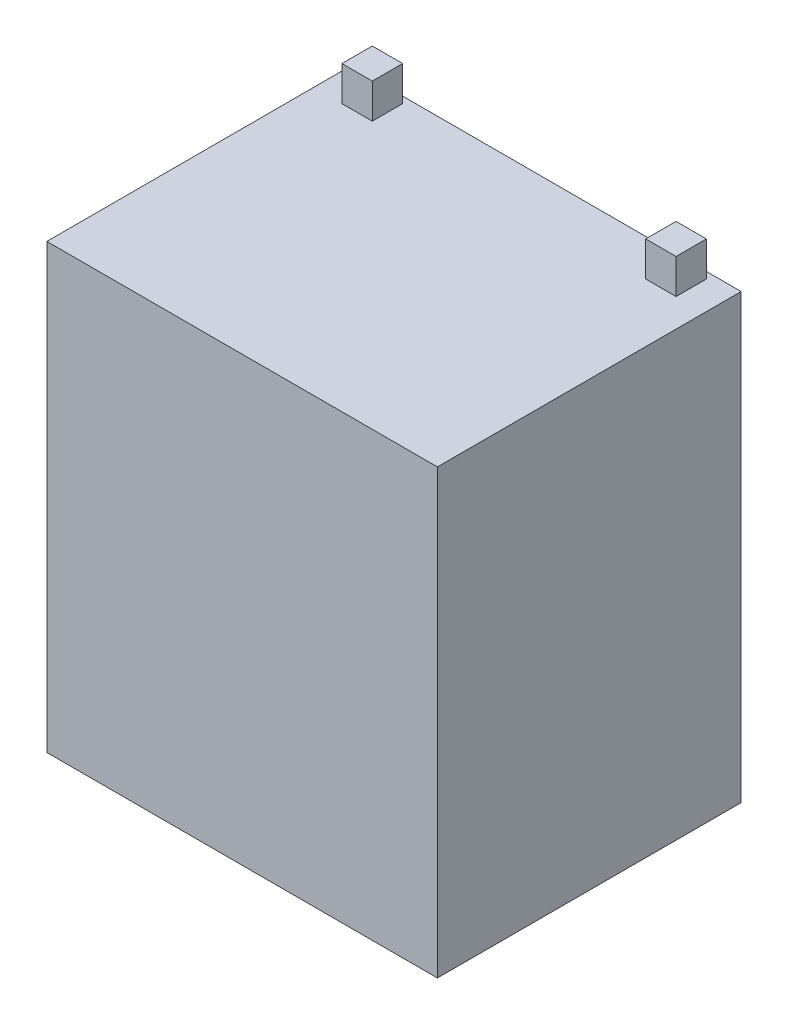
ISO-10303-21;
HEADER;
FILE_DESCRIPTION(('STEP AP214'),'2;1');
FILE_NAME('part.step','',(''),(''),'','','');
FILE_SCHEMA(('AUTOMOTIVE_DESIGN { 1 0 10303 214 1 1 1 1 }'));
ENDSEC;
DATA;
#1=APPLICATION_CONTEXT('core data for automotive mechanical design processes');
#2=APPLICATION_PROTOCOL_DEFINITION('international standard','automotive_design',2000,#1);
#3=PRODUCT_CONTEXT('',#1,'mechanical');
#4=PRODUCT('Part','Part','',(#3));
#5=PRODUCT_RELATED_PRODUCT_CATEGORY('part','',(#4));
#6=PRODUCT_DEFINITION_FORMATION('','',#4);
#7=PRODUCT_DEFINITION_CONTEXT('part definition',#1,'design');
#8=PRODUCT_DEFINITION('design','',#6,#7);
#9=PRODUCT_DEFINITION_SHAPE('','',#8);
#10=(LENGTH_UNIT() NAMED_UNIT(*) SI_UNIT(.MILLI.,.METRE.));
#11=(NAMED_UNIT(*) PLANE_ANGLE_UNIT() SI_UNIT($,.RADIAN.));
#12=(NAMED_UNIT(*) SI_UNIT($,.STERADIAN.) SOLID_ANGLE_UNIT());
#13=UNCERTAINTY_MEASURE_WITH_UNIT(LENGTH_MEASURE(1.E-05),#10,'distance_accuracy_value','');
#14=(GEOMETRIC_REPRESENTATION_CONTEXT(3) GLOBAL_UNCERTAINTY_ASSIGNED_CONTEXT((#13)) GLOBAL_UNIT_ASSIGNED_CONTEXT((#10,
#11,#12)) REPRESENTATION_CONTEXT('',''));
#15=CARTESIAN_POINT('',(0.,0.,0.));
#16=DIRECTION('',(0.,0.,1.));
#17=DIRECTION('',(1.,0.,0.));
#18=AXIS2_PLACEMENT_3D('',#15,#16,#17);
#19=CARTESIAN_POINT('',(45.,102.,-35.));
#20=DIRECTION('',(0.,-1.,0.));
#21=DIRECTION('',(0.,0.,-1.));
#22=AXIS2_PLACEMENT_3D('',#19,#20,#21);
#23=PLANE('',#22);
#24=DIRECTION('',(0.,0.,-1.));
#25=VECTOR('',#24,1.);
#26=CARTESIAN_POINT('',(-31.5,102.,-33.5));
#27=LINE('',#26,#25);
#28=CARTESIAN_POINT('',(-31.5,102.,-26.5));
#29=VERTEX_POINT('',#28);
#30=CARTESIAN_POINT('',(-31.5,102.,-33.5));
#31=VERTEX_POINT('',#30);
#32=EDGE_CURVE('E141',#29,#31,#27,.T.);
#33=ORIENTED_EDGE('',*,*,#32,.F.);
#34=DIRECTION('',(1.,0.,0.));
#35=VECTOR('',#34,1.);
#36=CARTESIAN_POINT('',(-38.5,102.,-26.5));
#37=LINE('',#36,#35);
#38=CARTESIAN_POINT('',(-38.5,102.,-26.5));
#39=VERTEX_POINT('',#38);
#40=EDGE_CURVE('E154',#39,#29,#37,.T.);
#41=ORIENTED_EDGE('',*,*,#40,.F.);
#42=DIRECTION('',(0.,0.,1.));
#43=VECTOR('',#42,1.);
#44=CARTESIAN_POINT('',(-38.5,102.,-33.5));
#45=LINE('',#44,#43);
#46=CARTESIAN_POINT('',(-38.5,102.,-33.5));
#47=VERTEX_POINT('',#46);
#48=EDGE_CURVE('E163',#47,#39,#45,.T.);
#49=ORIENTED_EDGE('',*,*,#48,.F.);
#50=DIRECTION('',(-1.,0.,0.));
#51=VECTOR('',#50,1.);
#52=CARTESIAN_POINT('',(-38.5,102.,-33.5));
#53=LINE('',#52,#51);
#54=EDGE_CURVE('E144',#31,#47,#53,.T.);
#55=ORIENTED_EDGE('',*,*,#54,.F.);
#56=EDGE_LOOP('',(#33,#41,#49,#55));
#57=FACE_BOUND('',#56,.T.);
#58=DIRECTION('',(0.,0.,-1.));
#59=VECTOR('',#58,1.);
#60=CARTESIAN_POINT('',(45.,102.,35.));
#61=LINE('',#60,#59);
#62=CARTESIAN_POINT('',(45.,102.,35.));
#63=VERTEX_POINT('',#62);
#64=CARTESIAN_POINT('',(45.,102.,-35.));
#65=VERTEX_POINT('',#64);
#66=EDGE_CURVE('E180',#63,#65,#61,.T.);
#67=ORIENTED_EDGE('',*,*,#66,.T.);
#68=DIRECTION('',(-1.,0.,0.));
#69=VECTOR('',#68,1.);
#70=CARTESIAN_POINT('',(-45.,102.,-35.));
#71=LINE('',#70,#69);
#72=CARTESIAN_POINT('',(-45.,102.,-35.));
#73=VERTEX_POINT('',#72);
#74=EDGE_CURVE('E183',#65,#73,#71,.T.);
#75=ORIENTED_EDGE('',*,*,#74,.T.);
#76=DIRECTION('',(0.,0.,1.));
#77=VECTOR('',#76,1.);
#78=CARTESIAN_POINT('',(-45.,102.,35.));
#79=LINE('',#78,#77);
#80=CARTESIAN_POINT('',(-45.,102.,35.));
#81=VERTEX_POINT('',#80);
#82=EDGE_CURVE('E186',#73,#81,#79,.T.);
#83=ORIENTED_EDGE('',*,*,#82,.T.);
#84=DIRECTION('',(1.,0.,0.));
#85=VECTOR('',#84,1.);
#86=CARTESIAN_POINT('',(-45.,102.,35.));
#87=LINE('',#86,#85);
#88=EDGE_CURVE('E188',#81,#63,#87,.T.);
#89=ORIENTED_EDGE('',*,*,#88,.T.);
#90=EDGE_LOOP('',(#67,#75,#83,#89));
#91=FACE_BOUND('',#90,.T.);
#92=DIRECTION('',(0.,0.,-1.));
#93=VECTOR('',#92,1.);
#94=CARTESIAN_POINT('',(38.5,102.,-33.5));
#95=LINE('',#94,#93);
#96=CARTESIAN_POINT('',(38.5,102.,-26.5));
#97=VERTEX_POINT('',#96);
#98=CARTESIAN_POINT('',(38.5,102.,-33.5));
#99=VERTEX_POINT('',#98);
#100=EDGE_CURVE('E140',#97,#99,#95,.T.);
#101=ORIENTED_EDGE('',*,*,#100,.F.);
#102=DIRECTION('',(1.,0.,0.));
#103=VECTOR('',#102,1.);
#104=CARTESIAN_POINT('',(38.5,102.,-26.5));
#105=LINE('',#104,#103);
#106=CARTESIAN_POINT('',(31.5,102.,-26.5));
#107=VERTEX_POINT('',#106);
#108=EDGE_CURVE('E137',#107,#97,#105,.T.);
#109=ORIENTED_EDGE('',*,*,#108,.F.);
#110=DIRECTION('',(0.,0.,1.));
#111=VECTOR('',#110,1.);
#112=CARTESIAN_POINT('',(31.5,102.,-33.5));
#113=LINE('',#112,#111);
#114=CARTESIAN_POINT('',(31.5,102.,-33.5));
#115=VERTEX_POINT('',#114);
#116=EDGE_CURVE('E51',#115,#107,#113,.T.);
#117=ORIENTED_EDGE('',*,*,#116,.F.);
#118=DIRECTION('',(-1.,0.,0.));
#119=VECTOR('',#118,1.);
#120=CARTESIAN_POINT('',(38.5,102.,-33.5));
#121=LINE('',#120,#119);
#122=EDGE_CURVE('E46',#99,#115,#121,.T.);
#123=ORIENTED_EDGE('',*,*,#122,.F.);
#124=EDGE_LOOP('',(#101,#109,#117,#123));
#125=FACE_BOUND('',#124,.T.);
#126=ADVANCED_FACE('F31',(#57,#91,#125),#23,.F.);
#127=CARTESIAN_POINT('',(45.,102.,35.));
#128=DIRECTION('',(-1.,0.,0.));
#129=DIRECTION('',(0.,0.,1.));
#130=AXIS2_PLACEMENT_3D('',#127,#128,#129);
#131=PLANE('',#130);
#132=DIRECTION('',(0.,0.,-1.));
#133=VECTOR('',#132,1.);
#134=CARTESIAN_POINT('',(45.,0.,35.));
#135=LINE('',#134,#133);
#136=CARTESIAN_POINT('',(45.,0.,35.));
#137=VERTEX_POINT('',#136);
#138=CARTESIAN_POINT('',(45.,0.,-35.));
#139=VERTEX_POINT('',#138);
#140=EDGE_CURVE('E179',#137,#139,#135,.T.);
#141=ORIENTED_EDGE('',*,*,#140,.T.);
#142=DIRECTION('',(0.,-1.,0.));
#143=VECTOR('',#142,1.);
#144=CARTESIAN_POINT('',(45.,102.,-35.));
#145=LINE('',#144,#143);
#146=EDGE_CURVE('E11',#65,#139,#145,.T.);
#147=ORIENTED_EDGE('',*,*,#146,.F.);
#148=ORIENTED_EDGE('',*,*,#66,.F.);
#149=DIRECTION('',(0.,-1.,0.));
#150=VECTOR('',#149,1.);
#151=CARTESIAN_POINT('',(45.,102.,35.));
#152=LINE('',#151,#150);
#153=EDGE_CURVE('E190',#63,#137,#152,.T.);
#154=ORIENTED_EDGE('',*,*,#153,.T.);
#155=EDGE_LOOP('',(#141,#147,#148,#154));
#156=FACE_BOUND('',#155,.T.);
#157=ADVANCED_FACE('F33',(#156),#131,.F.);
#158=CARTESIAN_POINT('',(-45.,102.,-35.));
#159=DIRECTION('',(0.,0.,1.));
#160=DIRECTION('',(1.,0.,0.));
#161=AXIS2_PLACEMENT_3D('',#158,#159,#160);
#162=PLANE('',#161);
#163=DIRECTION('',(-1.,0.,0.));
#164=VECTOR('',#163,1.);
#165=CARTESIAN_POINT('',(-45.,0.,-35.));
#166=LINE('',#165,#164);
#167=CARTESIAN_POINT('',(-45.,0.,-35.));
#168=VERTEX_POINT('',#167);
#169=EDGE_CURVE('E193',#139,#168,#166,.T.);
#170=ORIENTED_EDGE('',*,*,#169,.T.);
#171=DIRECTION('',(0.,-1.,0.));
#172=VECTOR('',#171,1.);
#173=CARTESIAN_POINT('',(-45.,102.,-35.));
#174=LINE('',#173,#172);
#175=EDGE_CURVE('E39',#73,#168,#174,.T.);
#176=ORIENTED_EDGE('',*,*,#175,.F.);
#177=ORIENTED_EDGE('',*,*,#74,.F.);
#178=ORIENTED_EDGE('',*,*,#146,.T.);
#179=EDGE_LOOP('',(#170,#176,#177,#178));
#180=FACE_BOUND('',#179,.T.);
#181=ADVANCED_FACE('F222',(#180),#162,.F.);
#182=CARTESIAN_POINT('',(-45.,102.,35.));
#183=DIRECTION('',(1.,0.,0.));
#184=DIRECTION('',(0.,0.,-1.));
#185=AXIS2_PLACEMENT_3D('',#182,#183,#184);
#186=PLANE('',#185);
#187=DIRECTION('',(0.,0.,1.));
#188=VECTOR('',#187,1.);
#189=CARTESIAN_POINT('',(-45.,0.,35.));
#190=LINE('',#189,#188);
#191=CARTESIAN_POINT('',(-45.,0.,35.));
#192=VERTEX_POINT('',#191);
#193=EDGE_CURVE('E195',#168,#192,#190,.T.);
#194=ORIENTED_EDGE('',*,*,#193,.T.);
#195=DIRECTION('',(0.,-1.,0.));
#196=VECTOR('',#195,1.);
#197=CARTESIAN_POINT('',(-45.,102.,35.));
#198=LINE('',#197,#196);
#199=EDGE_CURVE('E200',#81,#192,#198,.T.);
#200=ORIENTED_EDGE('',*,*,#199,.F.);
#201=ORIENTED_EDGE('',*,*,#82,.F.);
#202=ORIENTED_EDGE('',*,*,#175,.T.);
#203=EDGE_LOOP('',(#194,#200,#201,#202));
#204=FACE_BOUND('',#203,.T.);
#205=ADVANCED_FACE('F207',(#204),#186,.F.);
#206=CARTESIAN_POINT('',(-45.,102.,35.));
#207=DIRECTION('',(0.,0.,-1.));
#208=DIRECTION('',(-1.,0.,0.));
#209=AXIS2_PLACEMENT_3D('',#206,#207,#208);
#210=PLANE('',#209);
#211=DIRECTION('',(1.,0.,0.));
#212=VECTOR('',#211,1.);
#213=CARTESIAN_POINT('',(-45.,0.,35.));
#214=LINE('',#213,#212);
#215=EDGE_CURVE('E184',#192,#137,#214,.T.);
#216=ORIENTED_EDGE('',*,*,#215,.T.);
#217=ORIENTED_EDGE('',*,*,#153,.F.);
#218=ORIENTED_EDGE('',*,*,#88,.F.);
#219=ORIENTED_EDGE('',*,*,#199,.T.);
#220=EDGE_LOOP('',(#216,#217,#218,#219));
#221=FACE_BOUND('',#220,.T.);
#222=ADVANCED_FACE('F216',(#221),#210,.F.);
#223=CARTESIAN_POINT('',(45.,0.,-35.));
#224=DIRECTION('',(0.,-1.,0.));
#225=DIRECTION('',(0.,0.,-1.));
#226=AXIS2_PLACEMENT_3D('',#223,#224,#225);
#227=PLANE('',#226);
#228=ORIENTED_EDGE('',*,*,#140,.F.);
#229=ORIENTED_EDGE('',*,*,#215,.F.);
#230=ORIENTED_EDGE('',*,*,#193,.F.);
#231=ORIENTED_EDGE('',*,*,#169,.F.);
#232=EDGE_LOOP('',(#228,#229,#230,#231));
#233=FACE_BOUND('',#232,.T.);
#234=ADVANCED_FACE('F213',(#233),#227,.T.);
#235=CARTESIAN_POINT('',(-31.5,110.,-33.5));
#236=DIRECTION('',(-1.,0.,0.));
#237=DIRECTION('',(0.,0.,1.));
#238=AXIS2_PLACEMENT_3D('',#235,#236,#237);
#239=PLANE('',#238);
#240=ORIENTED_EDGE('',*,*,#32,.T.);
#241=DIRECTION('',(0.,-1.,0.));
#242=VECTOR('',#241,1.);
#243=CARTESIAN_POINT('',(-31.5,110.,-33.5));
#244=LINE('',#243,#242);
#245=CARTESIAN_POINT('',(-31.5,110.,-33.5));
#246=VERTEX_POINT('',#245);
#247=EDGE_CURVE('E176',#246,#31,#244,.T.);
#248=ORIENTED_EDGE('',*,*,#247,.F.);
#249=DIRECTION('',(0.,0.,-1.));
#250=VECTOR('',#249,1.);
#251=CARTESIAN_POINT('',(-31.5,110.,-33.5));
#252=LINE('',#251,#250);
#253=CARTESIAN_POINT('',(-31.5,110.,-26.5));
#254=VERTEX_POINT('',#253);
#255=EDGE_CURVE('E150',#254,#246,#252,.T.);
#256=ORIENTED_EDGE('',*,*,#255,.F.);
#257=DIRECTION('',(0.,-1.,0.));
#258=VECTOR('',#257,1.);
#259=CARTESIAN_POINT('',(-31.5,110.,-26.5));
#260=LINE('',#259,#258);
#261=EDGE_CURVE('E159',#254,#29,#260,.T.);
#262=ORIENTED_EDGE('',*,*,#261,.T.);
#263=EDGE_LOOP('',(#240,#248,#256,#262));
#264=FACE_BOUND('',#263,.T.);
#265=ADVANCED_FACE('F236',(#264),#239,.F.);
#266=CARTESIAN_POINT('',(-38.5,110.,-33.5));
#267=DIRECTION('',(0.,0.,1.));
#268=DIRECTION('',(1.,0.,0.));
#269=AXIS2_PLACEMENT_3D('',#266,#267,#268);
#270=PLANE('',#269);
#271=ORIENTED_EDGE('',*,*,#54,.T.);
#272=DIRECTION('',(0.,-1.,0.));
#273=VECTOR('',#272,1.);
#274=CARTESIAN_POINT('',(-38.5,110.,-33.5));
#275=LINE('',#274,#273);
#276=CARTESIAN_POINT('',(-38.5,110.,-33.5));
#277=VERTEX_POINT('',#276);
#278=EDGE_CURVE('E173',#277,#47,#275,.T.);
#279=ORIENTED_EDGE('',*,*,#278,.F.);
#280=DIRECTION('',(-1.,0.,0.));
#281=VECTOR('',#280,1.);
#282=CARTESIAN_POINT('',(-38.5,110.,-33.5));
#283=LINE('',#282,#281);
#284=EDGE_CURVE('E153',#246,#277,#283,.T.);
#285=ORIENTED_EDGE('',*,*,#284,.F.);
#286=ORIENTED_EDGE('',*,*,#247,.T.);
#287=EDGE_LOOP('',(#271,#279,#285,#286));
#288=FACE_BOUND('',#287,.T.);
#289=ADVANCED_FACE('F255',(#288),#270,.F.);
#290=CARTESIAN_POINT('',(-38.5,110.,-33.5));
#291=DIRECTION('',(1.,0.,0.));
#292=DIRECTION('',(0.,0.,-1.));
#293=AXIS2_PLACEMENT_3D('',#290,#291,#292);
#294=PLANE('',#293);
#295=ORIENTED_EDGE('',*,*,#48,.T.);
#296=DIRECTION('',(0.,-1.,0.));
#297=VECTOR('',#296,1.);
#298=CARTESIAN_POINT('',(-38.5,110.,-26.5));
#299=LINE('',#298,#297);
#300=CARTESIAN_POINT('',(-38.5,110.,-26.5));
#301=VERTEX_POINT('',#300);
#302=EDGE_CURVE('E170',#301,#39,#299,.T.);
#303=ORIENTED_EDGE('',*,*,#302,.F.);
#304=DIRECTION('',(0.,0.,1.));
#305=VECTOR('',#304,1.);
#306=CARTESIAN_POINT('',(-38.5,110.,-33.5));
#307=LINE('',#306,#305);
#308=EDGE_CURVE('E156',#277,#301,#307,.T.);
#309=ORIENTED_EDGE('',*,*,#308,.F.);
#310=ORIENTED_EDGE('',*,*,#278,.T.);
#311=EDGE_LOOP('',(#295,#303,#309,#310));
#312=FACE_BOUND('',#311,.T.);
#313=ADVANCED_FACE('F262',(#312),#294,.F.);
#314=CARTESIAN_POINT('',(-38.5,110.,-26.5));
#315=DIRECTION('',(0.,0.,-1.));
#316=DIRECTION('',(-1.,0.,0.));
#317=AXIS2_PLACEMENT_3D('',#314,#315,#316);
#318=PLANE('',#317);
#319=ORIENTED_EDGE('',*,*,#40,.T.);
#320=ORIENTED_EDGE('',*,*,#261,.F.);
#321=DIRECTION('',(1.,0.,0.));
#322=VECTOR('',#321,1.);
#323=CARTESIAN_POINT('',(-38.5,110.,-26.5));
#324=LINE('',#323,#322);
#325=EDGE_CURVE('E158',#301,#254,#324,.T.);
#326=ORIENTED_EDGE('',*,*,#325,.F.);
#327=ORIENTED_EDGE('',*,*,#302,.T.);
#328=EDGE_LOOP('',(#319,#320,#326,#327));
#329=FACE_BOUND('',#328,.T.);
#330=ADVANCED_FACE('F269',(#329),#318,.F.);
#331=CARTESIAN_POINT('',(-31.5,110.,-26.5));
#332=DIRECTION('',(0.,1.,0.));
#333=DIRECTION('',(0.,0.,1.));
#334=AXIS2_PLACEMENT_3D('',#331,#332,#333);
#335=PLANE('',#334);
#336=ORIENTED_EDGE('',*,*,#255,.T.);
#337=ORIENTED_EDGE('',*,*,#284,.T.);
#338=ORIENTED_EDGE('',*,*,#308,.T.);
#339=ORIENTED_EDGE('',*,*,#325,.T.);
#340=EDGE_LOOP('',(#336,#337,#338,#339));
#341=FACE_BOUND('',#340,.T.);
#342=ADVANCED_FACE('F277',(#341),#335,.T.);
#343=CARTESIAN_POINT('',(38.5,110.,-33.5));
#344=DIRECTION('',(-1.,0.,0.));
#345=DIRECTION('',(0.,0.,1.));
#346=AXIS2_PLACEMENT_3D('',#343,#344,#345);
#347=PLANE('',#346);
#348=ORIENTED_EDGE('',*,*,#100,.T.);
#349=DIRECTION('',(0.,-1.,0.));
#350=VECTOR('',#349,1.);
#351=CARTESIAN_POINT('',(38.5,110.,-33.5));
#352=LINE('',#351,#350);
#353=CARTESIAN_POINT('',(38.5,110.,-33.5));
#354=VERTEX_POINT('',#353);
#355=EDGE_CURVE('E121',#354,#99,#352,.T.);
#356=ORIENTED_EDGE('',*,*,#355,.F.);
#357=DIRECTION('',(0.,0.,-1.));
#358=VECTOR('',#357,1.);
#359=CARTESIAN_POINT('',(38.5,110.,-33.5));
#360=LINE('',#359,#358);
#361=CARTESIAN_POINT('',(38.5,110.,-26.5));
#362=VERTEX_POINT('',#361);
#363=EDGE_CURVE('E128',#362,#354,#360,.T.);
#364=ORIENTED_EDGE('',*,*,#363,.F.);
#365=DIRECTION('',(0.,-1.,0.));
#366=VECTOR('',#365,1.);
#367=CARTESIAN_POINT('',(38.5,110.,-26.5));
#368=LINE('',#367,#366);
#369=EDGE_CURVE('E366',#362,#97,#368,.T.);
#370=ORIENTED_EDGE('',*,*,#369,.T.);
#371=EDGE_LOOP('',(#348,#356,#364,#370));
#372=FACE_BOUND('',#371,.T.);
#373=ADVANCED_FACE('F139',(#372),#347,.F.);
#374=CARTESIAN_POINT('',(38.5,110.,-33.5));
#375=DIRECTION('',(0.,0.,1.));
#376=DIRECTION('',(1.,0.,0.));
#377=AXIS2_PLACEMENT_3D('',#374,#375,#376);
#378=PLANE('',#377);
#379=ORIENTED_EDGE('',*,*,#122,.T.);
#380=DIRECTION('',(0.,-1.,0.));
#381=VECTOR('',#380,1.);
#382=CARTESIAN_POINT('',(31.5,110.,-33.5));
#383=LINE('',#382,#381);
#384=CARTESIAN_POINT('',(31.5,110.,-33.5));
#385=VERTEX_POINT('',#384);
#386=EDGE_CURVE('E124',#385,#115,#383,.T.);
#387=ORIENTED_EDGE('',*,*,#386,.F.);
#388=DIRECTION('',(-1.,0.,0.));
#389=VECTOR('',#388,1.);
#390=CARTESIAN_POINT('',(38.5,110.,-33.5));
#391=LINE('',#390,#389);
#392=EDGE_CURVE('E117',#354,#385,#391,.T.);
#393=ORIENTED_EDGE('',*,*,#392,.F.);
#394=ORIENTED_EDGE('',*,*,#355,.T.);
#395=EDGE_LOOP('',(#379,#387,#393,#394));
#396=FACE_BOUND('',#395,.T.);
#397=ADVANCED_FACE('F119',(#396),#378,.F.);
#398=CARTESIAN_POINT('',(31.5,110.,-33.5));
#399=DIRECTION('',(1.,0.,0.));
#400=DIRECTION('',(0.,0.,-1.));
#401=AXIS2_PLACEMENT_3D('',#398,#399,#400);
#402=PLANE('',#401);
#403=ORIENTED_EDGE('',*,*,#116,.T.);
#404=DIRECTION('',(0.,-1.,0.));
#405=VECTOR('',#404,1.);
#406=CARTESIAN_POINT('',(31.5,110.,-26.5));
#407=LINE('',#406,#405);
#408=CARTESIAN_POINT('',(31.5,110.,-26.5));
#409=VERTEX_POINT('',#408);
#410=EDGE_CURVE('E146',#409,#107,#407,.T.);
#411=ORIENTED_EDGE('',*,*,#410,.F.);
#412=DIRECTION('',(0.,0.,1.));
#413=VECTOR('',#412,1.);
#414=CARTESIAN_POINT('',(31.5,110.,-33.5));
#415=LINE('',#414,#413);
#416=EDGE_CURVE('E127',#385,#409,#415,.T.);
#417=ORIENTED_EDGE('',*,*,#416,.F.);
#418=ORIENTED_EDGE('',*,*,#386,.T.);
#419=EDGE_LOOP('',(#403,#411,#417,#418));
#420=FACE_BOUND('',#419,.T.);
#421=ADVANCED_FACE('F298',(#420),#402,.F.);
#422=CARTESIAN_POINT('',(38.5,110.,-26.5));
#423=DIRECTION('',(0.,0.,-1.));
#424=DIRECTION('',(-1.,0.,0.));
#425=AXIS2_PLACEMENT_3D('',#422,#423,#424);
#426=PLANE('',#425);
#427=ORIENTED_EDGE('',*,*,#108,.T.);
#428=ORIENTED_EDGE('',*,*,#369,.F.);
#429=DIRECTION('',(1.,0.,0.));
#430=VECTOR('',#429,1.);
#431=CARTESIAN_POINT('',(38.5,110.,-26.5));
#432=LINE('',#431,#430);
#433=EDGE_CURVE('E133',#409,#362,#432,.T.);
#434=ORIENTED_EDGE('',*,*,#433,.F.);
#435=ORIENTED_EDGE('',*,*,#410,.T.);
#436=EDGE_LOOP('',(#427,#428,#434,#435));
#437=FACE_BOUND('',#436,.T.);
#438=ADVANCED_FACE('F305',(#437),#426,.F.);
#439=CARTESIAN_POINT('',(38.5,110.,-26.5));
#440=DIRECTION('',(0.,-1.,0.));
#441=DIRECTION('',(0.,0.,-1.));
#442=AXIS2_PLACEMENT_3D('',#439,#440,#441);
#443=PLANE('',#442);
#444=ORIENTED_EDGE('',*,*,#363,.T.);
#445=ORIENTED_EDGE('',*,*,#392,.T.);
#446=ORIENTED_EDGE('',*,*,#416,.T.);
#447=ORIENTED_EDGE('',*,*,#433,.T.);
#448=EDGE_LOOP('',(#444,#445,#446,#447));
#449=FACE_BOUND('',#448,.T.);
#450=ADVANCED_FACE('F131',(#449),#443,.F.);
#451=CLOSED_SHELL('',(#126,#157,#181,#205,#222,#234,#265,#289,#313,#330,#342,#373,#397,#421,
#438,#450));
#452=MANIFOLD_SOLID_BREP('B2',#451);
#453=ADVANCED_BREP_SHAPE_REPRESENTATION('',(#18,#452),#14);
#454=SHAPE_DEFINITION_REPRESENTATION(#9,#453);
ENDSEC;
END-ISO-10303-21;
